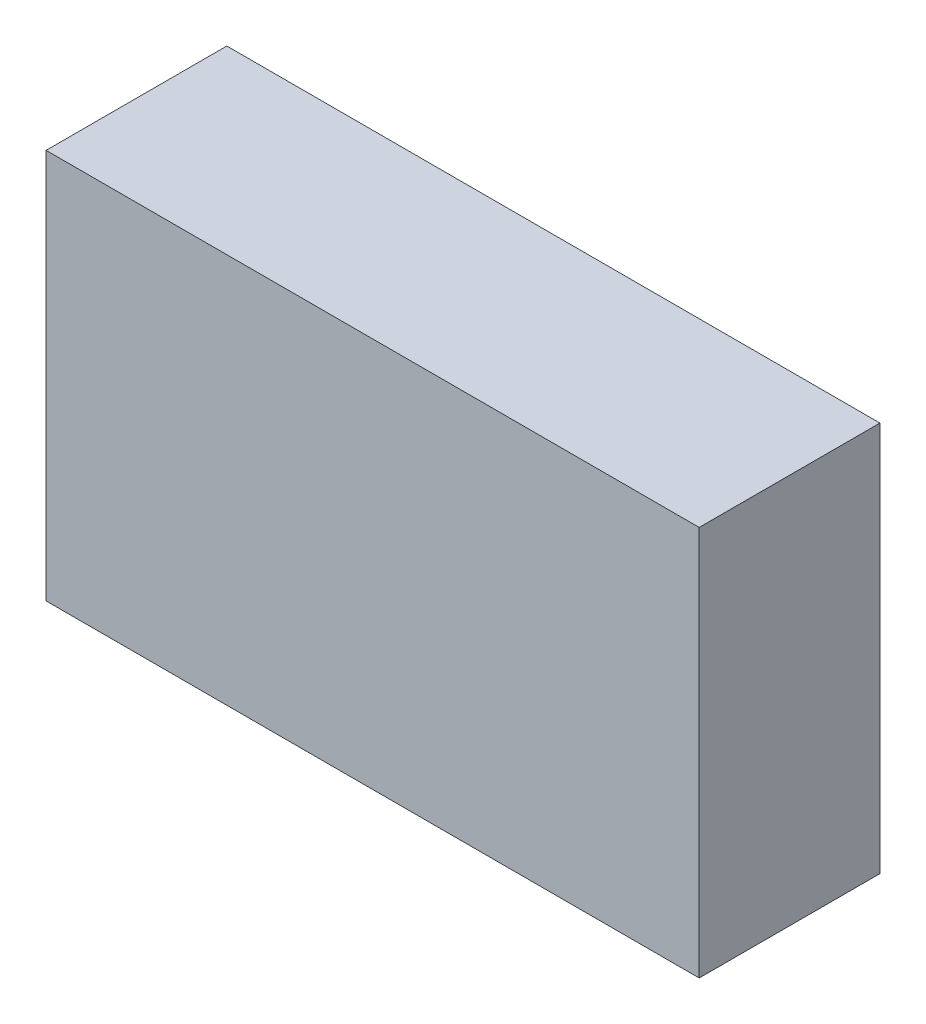
ISO-10303-21;
HEADER;
FILE_DESCRIPTION(('STEP AP214'),'2;1');
FILE_NAME('part.step','',(''),(''),'','','');
FILE_SCHEMA(('AUTOMOTIVE_DESIGN { 1 0 10303 214 1 1 1 1 }'));
ENDSEC;
DATA;
#1=APPLICATION_CONTEXT('core data for automotive mechanical design processes');
#2=APPLICATION_PROTOCOL_DEFINITION('international standard','automotive_design',2000,#1);
#3=PRODUCT_CONTEXT('',#1,'mechanical');
#4=PRODUCT('Part','Part','',(#3));
#5=PRODUCT_RELATED_PRODUCT_CATEGORY('part','',(#4));
#6=PRODUCT_DEFINITION_FORMATION('','',#4);
#7=PRODUCT_DEFINITION_CONTEXT('part definition',#1,'design');
#8=PRODUCT_DEFINITION('design','',#6,#7);
#9=PRODUCT_DEFINITION_SHAPE('','',#8);
#10=(LENGTH_UNIT() NAMED_UNIT(*) SI_UNIT(.MILLI.,.METRE.));
#11=(NAMED_UNIT(*) PLANE_ANGLE_UNIT() SI_UNIT($,.RADIAN.));
#12=(NAMED_UNIT(*) SI_UNIT($,.STERADIAN.) SOLID_ANGLE_UNIT());
#13=UNCERTAINTY_MEASURE_WITH_UNIT(LENGTH_MEASURE(1.E-05),#10,'distance_accuracy_value','');
#14=(GEOMETRIC_REPRESENTATION_CONTEXT(3) GLOBAL_UNCERTAINTY_ASSIGNED_CONTEXT((#13)) GLOBAL_UNIT_ASSIGNED_CONTEXT((#10,
#11,#12)) REPRESENTATION_CONTEXT('',''));
#15=CARTESIAN_POINT('',(0.,0.,0.));
#16=DIRECTION('',(0.,0.,1.));
#17=DIRECTION('',(1.,0.,0.));
#18=AXIS2_PLACEMENT_3D('',#15,#16,#17);
#19=CARTESIAN_POINT('',(0.055,0.,0.495));
#20=DIRECTION('',(0.,0.,1.));
#21=DIRECTION('',(1.,0.,0.));
#22=AXIS2_PLACEMENT_3D('',#19,#20,#21);
#23=PLANE('',#22);
#24=DIRECTION('',(0.,1.,0.));
#25=VECTOR('',#24,1.);
#26=CARTESIAN_POINT('',(1.645,0.,0.495));
#27=LINE('',#26,#25);
#28=CARTESIAN_POINT('',(1.645,0.95,0.495));
#29=VERTEX_POINT('',#28);
#30=CARTESIAN_POINT('',(1.645,0.,0.495));
#31=VERTEX_POINT('',#30);
#32=EDGE_CURVE('E76',#29,#31,#27,.F.);
#33=ORIENTED_EDGE('',*,*,#32,.F.);
#34=DIRECTION('',(1.,0.,0.));
#35=VECTOR('',#34,1.);
#36=CARTESIAN_POINT('',(0.055,0.95,0.495));
#37=LINE('',#36,#35);
#38=CARTESIAN_POINT('',(0.055,0.95,0.495));
#39=VERTEX_POINT('',#38);
#40=EDGE_CURVE('E58',#39,#29,#37,.T.);
#41=ORIENTED_EDGE('',*,*,#40,.F.);
#42=DIRECTION('',(0.,1.,0.));
#43=VECTOR('',#42,1.);
#44=CARTESIAN_POINT('',(0.055,0.,0.495));
#45=LINE('',#44,#43);
#46=CARTESIAN_POINT('',(0.055,0.,0.495));
#47=VERTEX_POINT('',#46);
#48=EDGE_CURVE('E20',#39,#47,#45,.F.);
#49=ORIENTED_EDGE('',*,*,#48,.T.);
#50=DIRECTION('',(1.,0.,0.));
#51=VECTOR('',#50,1.);
#52=CARTESIAN_POINT('',(0.055,0.,0.495));
#53=LINE('',#52,#51);
#54=EDGE_CURVE('E55',#47,#31,#53,.T.);
#55=ORIENTED_EDGE('',*,*,#54,.T.);
#56=EDGE_LOOP('',(#33,#41,#49,#55));
#57=FACE_BOUND('',#56,.T.);
#58=ADVANCED_FACE('F17',(#57),#23,.T.);
#59=CARTESIAN_POINT('',(0.055,0.,0.055));
#60=DIRECTION('',(1.,0.,0.));
#61=DIRECTION('',(0.,0.,-1.));
#62=AXIS2_PLACEMENT_3D('',#59,#60,#61);
#63=PLANE('',#62);
#64=DIRECTION('',(0.,0.,1.));
#65=VECTOR('',#64,1.);
#66=CARTESIAN_POINT('',(0.055,0.95,0.055));
#67=LINE('',#66,#65);
#68=CARTESIAN_POINT('',(0.055,0.95,0.055));
#69=VERTEX_POINT('',#68);
#70=EDGE_CURVE('E78',#69,#39,#67,.T.);
#71=ORIENTED_EDGE('',*,*,#70,.F.);
#72=DIRECTION('',(0.,1.,0.));
#73=VECTOR('',#72,1.);
#74=CARTESIAN_POINT('',(0.055,0.,0.055));
#75=LINE('',#74,#73);
#76=CARTESIAN_POINT('',(0.055,0.,0.055));
#77=VERTEX_POINT('',#76);
#78=EDGE_CURVE('E73',#69,#77,#75,.F.);
#79=ORIENTED_EDGE('',*,*,#78,.T.);
#80=DIRECTION('',(0.,0.,1.));
#81=VECTOR('',#80,1.);
#82=CARTESIAN_POINT('',(0.055,0.,0.055));
#83=LINE('',#82,#81);
#84=EDGE_CURVE('E63',#77,#47,#83,.T.);
#85=ORIENTED_EDGE('',*,*,#84,.T.);
#86=ORIENTED_EDGE('',*,*,#48,.F.);
#87=EDGE_LOOP('',(#71,#79,#85,#86));
#88=FACE_BOUND('',#87,.T.);
#89=ADVANCED_FACE('F72',(#88),#63,.F.);
#90=CARTESIAN_POINT('',(0.055,0.,0.055));
#91=DIRECTION('',(0.,1.,0.));
#92=DIRECTION('',(0.,0.,1.));
#93=AXIS2_PLACEMENT_3D('',#90,#91,#92);
#94=PLANE('',#93);
#95=ORIENTED_EDGE('',*,*,#54,.F.);
#96=ORIENTED_EDGE('',*,*,#84,.F.);
#97=DIRECTION('',(1.,0.,0.));
#98=VECTOR('',#97,1.);
#99=CARTESIAN_POINT('',(0.055,0.,0.055));
#100=LINE('',#99,#98);
#101=CARTESIAN_POINT('',(1.645,0.,0.055));
#102=VERTEX_POINT('',#101);
#103=EDGE_CURVE('E83',#77,#102,#100,.T.);
#104=ORIENTED_EDGE('',*,*,#103,.T.);
#105=DIRECTION('',(0.,0.,-1.));
#106=VECTOR('',#105,1.);
#107=CARTESIAN_POINT('',(1.645,0.,0.055));
#108=LINE('',#107,#106);
#109=EDGE_CURVE('E69',#31,#102,#108,.T.);
#110=ORIENTED_EDGE('',*,*,#109,.F.);
#111=EDGE_LOOP('',(#95,#96,#104,#110));
#112=FACE_BOUND('',#111,.T.);
#113=ADVANCED_FACE('F66',(#112),#94,.F.);
#114=CARTESIAN_POINT('',(1.645,0.,0.055));
#115=DIRECTION('',(1.,0.,0.));
#116=DIRECTION('',(0.,0.,-1.));
#117=AXIS2_PLACEMENT_3D('',#114,#115,#116);
#118=PLANE('',#117);
#119=DIRECTION('',(0.,0.,1.));
#120=VECTOR('',#119,1.);
#121=CARTESIAN_POINT('',(1.645,0.95,0.055));
#122=LINE('',#121,#120);
#123=CARTESIAN_POINT('',(1.645,0.95,0.055));
#124=VERTEX_POINT('',#123);
#125=EDGE_CURVE('E34',#29,#124,#122,.F.);
#126=ORIENTED_EDGE('',*,*,#125,.F.);
#127=ORIENTED_EDGE('',*,*,#32,.T.);
#128=ORIENTED_EDGE('',*,*,#109,.T.);
#129=DIRECTION('',(0.,1.,0.));
#130=VECTOR('',#129,1.);
#131=CARTESIAN_POINT('',(1.645,0.,0.055));
#132=LINE('',#131,#130);
#133=EDGE_CURVE('E26',#102,#124,#132,.T.);
#134=ORIENTED_EDGE('',*,*,#133,.T.);
#135=EDGE_LOOP('',(#126,#127,#128,#134));
#136=FACE_BOUND('',#135,.T.);
#137=ADVANCED_FACE('F88',(#136),#118,.T.);
#138=CARTESIAN_POINT('',(0.055,0.95,0.055));
#139=DIRECTION('',(0.,1.,0.));
#140=DIRECTION('',(0.,0.,1.));
#141=AXIS2_PLACEMENT_3D('',#138,#139,#140);
#142=PLANE('',#141);
#143=ORIENTED_EDGE('',*,*,#40,.T.);
#144=ORIENTED_EDGE('',*,*,#125,.T.);
#145=DIRECTION('',(1.,0.,0.));
#146=VECTOR('',#145,1.);
#147=CARTESIAN_POINT('',(0.055,0.95,0.055));
#148=LINE('',#147,#146);
#149=EDGE_CURVE('E11',#124,#69,#148,.F.);
#150=ORIENTED_EDGE('',*,*,#149,.T.);
#151=ORIENTED_EDGE('',*,*,#70,.T.);
#152=EDGE_LOOP('',(#143,#144,#150,#151));
#153=FACE_BOUND('',#152,.T.);
#154=ADVANCED_FACE('F91',(#153),#142,.T.);
#155=CARTESIAN_POINT('',(0.055,0.,0.055));
#156=DIRECTION('',(0.,0.,1.));
#157=DIRECTION('',(1.,0.,0.));
#158=AXIS2_PLACEMENT_3D('',#155,#156,#157);
#159=PLANE('',#158);
#160=ORIENTED_EDGE('',*,*,#133,.F.);
#161=ORIENTED_EDGE('',*,*,#103,.F.);
#162=ORIENTED_EDGE('',*,*,#78,.F.);
#163=ORIENTED_EDGE('',*,*,#149,.F.);
#164=EDGE_LOOP('',(#160,#161,#162,#163));
#165=FACE_BOUND('',#164,.T.);
#166=ADVANCED_FACE('F90',(#165),#159,.F.);
#167=CLOSED_SHELL('',(#58,#89,#113,#137,#154,#166));
#168=MANIFOLD_SOLID_BREP('B1',#167);
#169=ADVANCED_BREP_SHAPE_REPRESENTATION('',(#18,#168),#14);
#170=SHAPE_DEFINITION_REPRESENTATION(#9,#169);
ENDSEC;
END-ISO-10303-21;
